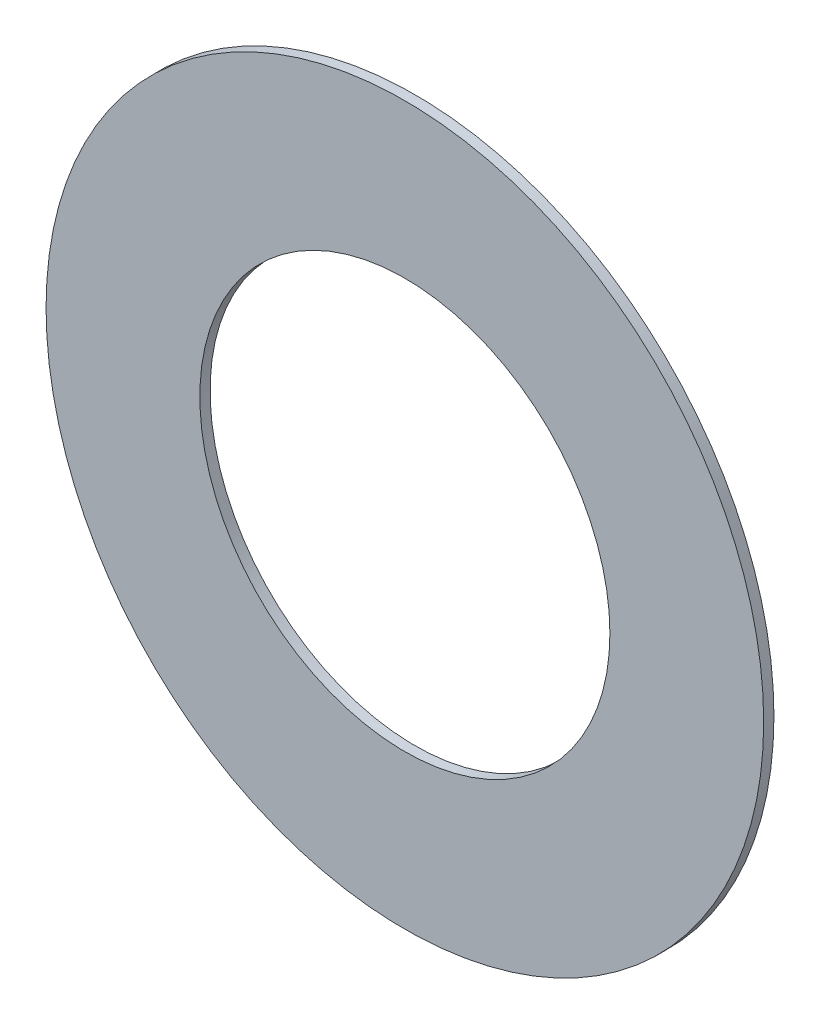
ISO-10303-21;
HEADER;
FILE_DESCRIPTION(('STEP AP214'),'2;1');
FILE_NAME('part.step','',(''),(''),'','','');
FILE_SCHEMA(('AUTOMOTIVE_DESIGN { 1 0 10303 214 1 1 1 1 }'));
ENDSEC;
DATA;
#1=APPLICATION_CONTEXT('core data for automotive mechanical design processes');
#2=APPLICATION_PROTOCOL_DEFINITION('international standard','automotive_design',2000,#1);
#3=PRODUCT_CONTEXT('',#1,'mechanical');
#4=PRODUCT('Part','Part','',(#3));
#5=PRODUCT_RELATED_PRODUCT_CATEGORY('part','',(#4));
#6=PRODUCT_DEFINITION_FORMATION('','',#4);
#7=PRODUCT_DEFINITION_CONTEXT('part definition',#1,'design');
#8=PRODUCT_DEFINITION('design','',#6,#7);
#9=PRODUCT_DEFINITION_SHAPE('','',#8);
#10=(LENGTH_UNIT() NAMED_UNIT(*) SI_UNIT(.MILLI.,.METRE.));
#11=(NAMED_UNIT(*) PLANE_ANGLE_UNIT() SI_UNIT($,.RADIAN.));
#12=(NAMED_UNIT(*) SI_UNIT($,.STERADIAN.) SOLID_ANGLE_UNIT());
#13=UNCERTAINTY_MEASURE_WITH_UNIT(LENGTH_MEASURE(1.E-05),#10,'distance_accuracy_value','');
#14=(GEOMETRIC_REPRESENTATION_CONTEXT(3) GLOBAL_UNCERTAINTY_ASSIGNED_CONTEXT((#13)) GLOBAL_UNIT_ASSIGNED_CONTEXT((#10,
#11,#12)) REPRESENTATION_CONTEXT('',''));
#15=CARTESIAN_POINT('',(0.,0.,0.));
#16=DIRECTION('',(0.,0.,1.));
#17=DIRECTION('',(1.,0.,0.));
#18=AXIS2_PLACEMENT_3D('',#15,#16,#17);
#19=CARTESIAN_POINT('',(0.,0.,0.1));
#20=DIRECTION('',(0.,0.,1.));
#21=DIRECTION('',(1.,0.,0.));
#22=AXIS2_PLACEMENT_3D('',#19,#20,#21);
#23=PLANE('',#22);
#24=CARTESIAN_POINT('',(0.,0.,0.1));
#25=DIRECTION('',(0.,0.,1.));
#26=DIRECTION('',(1.,0.,0.));
#27=AXIS2_PLACEMENT_3D('',#24,#25,#26);
#28=CIRCLE('',#27,3.5);
#29=CARTESIAN_POINT('',(3.5,0.,0.1));
#30=VERTEX_POINT('',#29);
#31=EDGE_CURVE('E10',#30,#30,#28,.T.);
#32=ORIENTED_EDGE('',*,*,#31,.T.);
#33=EDGE_LOOP('',(#32));
#34=FACE_BOUND('',#33,.T.);
#35=CARTESIAN_POINT('',(0.,0.,0.1));
#36=DIRECTION('',(0.,0.,1.));
#37=DIRECTION('',(1.,0.,0.));
#38=AXIS2_PLACEMENT_3D('',#35,#36,#37);
#39=CIRCLE('',#38,2.);
#40=CARTESIAN_POINT('',(2.,0.,0.1));
#41=VERTEX_POINT('',#40);
#42=EDGE_CURVE('E50',#41,#41,#39,.T.);
#43=ORIENTED_EDGE('',*,*,#42,.F.);
#44=EDGE_LOOP('',(#43));
#45=FACE_BOUND('',#44,.T.);
#46=ADVANCED_FACE('F37',(#34,#45),#23,.T.);
#47=CARTESIAN_POINT('',(0.,0.,0.));
#48=DIRECTION('',(0.,0.,1.));
#49=DIRECTION('',(1.,0.,0.));
#50=AXIS2_PLACEMENT_3D('',#47,#48,#49);
#51=PLANE('',#50);
#52=CARTESIAN_POINT('',(0.,0.,0.));
#53=DIRECTION('',(0.,0.,1.));
#54=DIRECTION('',(1.,0.,0.));
#55=AXIS2_PLACEMENT_3D('',#52,#53,#54);
#56=CIRCLE('',#55,3.5);
#57=CARTESIAN_POINT('',(3.5,0.,0.));
#58=VERTEX_POINT('',#57);
#59=EDGE_CURVE('E41',#58,#58,#56,.T.);
#60=ORIENTED_EDGE('',*,*,#59,.F.);
#61=EDGE_LOOP('',(#60));
#62=FACE_BOUND('',#61,.T.);
#63=CARTESIAN_POINT('',(0.,0.,0.));
#64=DIRECTION('',(0.,0.,1.));
#65=DIRECTION('',(1.,0.,0.));
#66=AXIS2_PLACEMENT_3D('',#63,#64,#65);
#67=CIRCLE('',#66,2.);
#68=CARTESIAN_POINT('',(2.,0.,0.));
#69=VERTEX_POINT('',#68);
#70=EDGE_CURVE('E52',#69,#69,#67,.T.);
#71=ORIENTED_EDGE('',*,*,#70,.T.);
#72=EDGE_LOOP('',(#71));
#73=FACE_BOUND('',#72,.T.);
#74=ADVANCED_FACE('F64',(#62,#73),#51,.F.);
#75=CARTESIAN_POINT('',(0.,0.,0.1));
#76=DIRECTION('',(0.,0.,-1.));
#77=DIRECTION('',(-1.,0.,0.));
#78=AXIS2_PLACEMENT_3D('',#75,#76,#77);
#79=CYLINDRICAL_SURFACE('',#78,3.5);
#80=ORIENTED_EDGE('',*,*,#31,.F.);
#81=EDGE_LOOP('',(#80));
#82=FACE_BOUND('',#81,.T.);
#83=ORIENTED_EDGE('',*,*,#59,.T.);
#84=EDGE_LOOP('',(#83));
#85=FACE_BOUND('',#84,.T.);
#86=ADVANCED_FACE('F39',(#82,#85),#79,.T.);
#87=CARTESIAN_POINT('',(0.,0.,0.1));
#88=DIRECTION('',(0.,0.,-1.));
#89=DIRECTION('',(-1.,0.,0.));
#90=AXIS2_PLACEMENT_3D('',#87,#88,#89);
#91=CYLINDRICAL_SURFACE('',#90,2.);
#92=ORIENTED_EDGE('',*,*,#42,.T.);
#93=EDGE_LOOP('',(#92));
#94=FACE_BOUND('',#93,.T.);
#95=ORIENTED_EDGE('',*,*,#70,.F.);
#96=EDGE_LOOP('',(#95));
#97=FACE_BOUND('',#96,.T.);
#98=ADVANCED_FACE('F60',(#94,#97),#91,.F.);
#99=CLOSED_SHELL('',(#46,#74,#86,#98));
#100=MANIFOLD_SOLID_BREP('B2',#99);
#101=ADVANCED_BREP_SHAPE_REPRESENTATION('',(#18,#100),#14);
#102=SHAPE_DEFINITION_REPRESENTATION(#9,#101);
ENDSEC;
END-ISO-10303-21;
